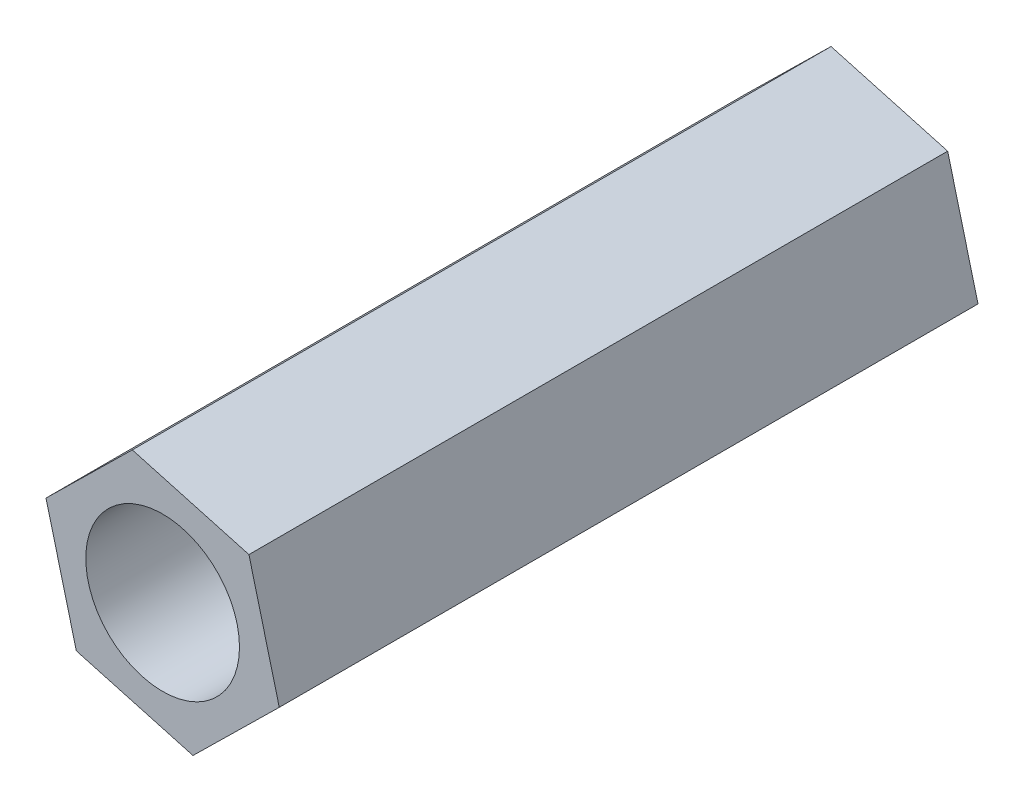
ISO-10303-21;
HEADER;
FILE_DESCRIPTION(('STEP AP214'),'2;1');
FILE_NAME('part.step','',(''),(''),'','','');
FILE_SCHEMA(('AUTOMOTIVE_DESIGN { 1 0 10303 214 1 1 1 1 }'));
ENDSEC;
DATA;
#1=APPLICATION_CONTEXT('core data for automotive mechanical design processes');
#2=APPLICATION_PROTOCOL_DEFINITION('international standard','automotive_design',2000,#1);
#3=PRODUCT_CONTEXT('',#1,'mechanical');
#4=PRODUCT('Part','Part','',(#3));
#5=PRODUCT_RELATED_PRODUCT_CATEGORY('part','',(#4));
#6=PRODUCT_DEFINITION_FORMATION('','',#4);
#7=PRODUCT_DEFINITION_CONTEXT('part definition',#1,'design');
#8=PRODUCT_DEFINITION('design','',#6,#7);
#9=PRODUCT_DEFINITION_SHAPE('','',#8);
#10=(LENGTH_UNIT() NAMED_UNIT(*) SI_UNIT(.MILLI.,.METRE.));
#11=(NAMED_UNIT(*) PLANE_ANGLE_UNIT() SI_UNIT($,.RADIAN.));
#12=(NAMED_UNIT(*) SI_UNIT($,.STERADIAN.) SOLID_ANGLE_UNIT());
#13=UNCERTAINTY_MEASURE_WITH_UNIT(LENGTH_MEASURE(1.E-05),#10,'distance_accuracy_value','');
#14=(GEOMETRIC_REPRESENTATION_CONTEXT(3) GLOBAL_UNCERTAINTY_ASSIGNED_CONTEXT((#13)) GLOBAL_UNIT_ASSIGNED_CONTEXT((#10,
#11,#12)) REPRESENTATION_CONTEXT('',''));
#15=CARTESIAN_POINT('',(0.,0.,0.));
#16=DIRECTION('',(0.,0.,1.));
#17=DIRECTION('',(1.,0.,0.));
#18=AXIS2_PLACEMENT_3D('',#15,#16,#17);
#19=CARTESIAN_POINT('',(0.,0.,15.));
#20=DIRECTION('',(0.,0.,1.));
#21=DIRECTION('',(1.,0.,0.));
#22=AXIS2_PLACEMENT_3D('',#19,#20,#21);
#23=PLANE('',#22);
#24=DIRECTION('',(-0.250589324723524,0.968093482229174,0.));
#25=VECTOR('',#24,1.);
#26=CARTESIAN_POINT('',(2.50373541670728,-0.693764342644977,15.));
#27=LINE('',#26,#25);
#28=CARTESIAN_POINT('',(2.50373541670728,-0.693764342644977,15.));
#29=VERTEX_POINT('',#28);
#30=CARTESIAN_POINT('',(1.852685253324,1.82141630390083,15.));
#31=VERTEX_POINT('',#30);
#32=EDGE_CURVE('E131',#29,#31,#27,.T.);
#33=ORIENTED_EDGE('',*,*,#32,.T.);
#34=DIRECTION('',(-0.963688211210366,0.267030019986828,0.));
#35=VECTOR('',#34,1.);
#36=CARTESIAN_POINT('',(1.852685253324,1.82141630390083,15.));
#37=LINE('',#36,#35);
#38=CARTESIAN_POINT('',(-0.651050163383279,2.51518064654581,15.));
#39=VERTEX_POINT('',#38);
#40=EDGE_CURVE('E89',#31,#39,#37,.T.);
#41=ORIENTED_EDGE('',*,*,#40,.T.);
#42=DIRECTION('',(-0.713098886486842,-0.701063462242347,0.));
#43=VECTOR('',#42,1.);
#44=CARTESIAN_POINT('',(-0.651050163383279,2.51518064654581,15.));
#45=LINE('',#44,#43);
#46=CARTESIAN_POINT('',(-2.50373541670728,0.693764342644976,15.));
#47=VERTEX_POINT('',#46);
#48=EDGE_CURVE('E102',#39,#47,#45,.T.);
#49=ORIENTED_EDGE('',*,*,#48,.T.);
#50=DIRECTION('',(0.250589324723524,-0.968093482229174,0.));
#51=VECTOR('',#50,1.);
#52=CARTESIAN_POINT('',(-2.50373541670728,0.693764342644976,15.));
#53=LINE('',#52,#51);
#54=CARTESIAN_POINT('',(-1.852685253324,-1.82141630390084,15.));
#55=VERTEX_POINT('',#54);
#56=EDGE_CURVE('E96',#47,#55,#53,.T.);
#57=ORIENTED_EDGE('',*,*,#56,.T.);
#58=DIRECTION('',(0.963688211210366,-0.267030019986827,0.));
#59=VECTOR('',#58,1.);
#60=CARTESIAN_POINT('',(-1.852685253324,-1.82141630390084,15.));
#61=LINE('',#60,#59);
#62=CARTESIAN_POINT('',(0.651050163383279,-2.51518064654581,15.));
#63=VERTEX_POINT('',#62);
#64=EDGE_CURVE('E100',#55,#63,#61,.T.);
#65=ORIENTED_EDGE('',*,*,#64,.T.);
#66=DIRECTION('',(0.713098886486842,0.701063462242347,0.));
#67=VECTOR('',#66,1.);
#68=CARTESIAN_POINT('',(0.651050163383279,-2.51518064654581,15.));
#69=LINE('',#68,#67);
#70=EDGE_CURVE('E52',#63,#29,#69,.T.);
#71=ORIENTED_EDGE('',*,*,#70,.T.);
#72=EDGE_LOOP('',(#33,#41,#49,#57,#65,#71));
#73=FACE_BOUND('',#72,.T.);
#74=CARTESIAN_POINT('',(0.,0.,15.));
#75=DIRECTION('',(0.,0.,1.));
#76=DIRECTION('',(1.,0.,0.));
#77=AXIS2_PLACEMENT_3D('',#74,#75,#76);
#78=CIRCLE('',#77,1.65);
#79=CARTESIAN_POINT('',(1.65,0.,15.));
#80=VERTEX_POINT('',#79);
#81=EDGE_CURVE('E124',#80,#80,#78,.T.);
#82=ORIENTED_EDGE('',*,*,#81,.F.);
#83=EDGE_LOOP('',(#82));
#84=FACE_BOUND('',#83,.T.);
#85=ADVANCED_FACE('F35',(#73,#84),#23,.T.);
#86=CARTESIAN_POINT('',(0.,0.,0.));
#87=DIRECTION('',(0.,0.,1.));
#88=DIRECTION('',(1.,0.,0.));
#89=AXIS2_PLACEMENT_3D('',#86,#87,#88);
#90=PLANE('',#89);
#91=DIRECTION('',(-0.250589324723524,0.968093482229174,0.));
#92=VECTOR('',#91,1.);
#93=CARTESIAN_POINT('',(2.50373541670728,-0.693764342644977,0.));
#94=LINE('',#93,#92);
#95=CARTESIAN_POINT('',(2.50373541670728,-0.693764342644977,0.));
#96=VERTEX_POINT('',#95);
#97=CARTESIAN_POINT('',(1.852685253324,1.82141630390083,0.));
#98=VERTEX_POINT('',#97);
#99=EDGE_CURVE('E120',#96,#98,#94,.T.);
#100=ORIENTED_EDGE('',*,*,#99,.F.);
#101=DIRECTION('',(0.713098886486842,0.701063462242347,0.));
#102=VECTOR('',#101,1.);
#103=CARTESIAN_POINT('',(0.651050163383279,-2.51518064654581,0.));
#104=LINE('',#103,#102);
#105=CARTESIAN_POINT('',(0.651050163383279,-2.51518064654581,0.));
#106=VERTEX_POINT('',#105);
#107=EDGE_CURVE('E81',#106,#96,#104,.T.);
#108=ORIENTED_EDGE('',*,*,#107,.F.);
#109=DIRECTION('',(0.963688211210366,-0.267030019986827,0.));
#110=VECTOR('',#109,1.);
#111=CARTESIAN_POINT('',(-1.852685253324,-1.82141630390084,0.));
#112=LINE('',#111,#110);
#113=CARTESIAN_POINT('',(-1.852685253324,-1.82141630390084,0.));
#114=VERTEX_POINT('',#113);
#115=EDGE_CURVE('E75',#114,#106,#112,.T.);
#116=ORIENTED_EDGE('',*,*,#115,.F.);
#117=DIRECTION('',(0.250589324723524,-0.968093482229174,0.));
#118=VECTOR('',#117,1.);
#119=CARTESIAN_POINT('',(-2.50373541670728,0.693764342644976,0.));
#120=LINE('',#119,#118);
#121=CARTESIAN_POINT('',(-2.50373541670728,0.693764342644976,0.));
#122=VERTEX_POINT('',#121);
#123=EDGE_CURVE('E110',#122,#114,#120,.T.);
#124=ORIENTED_EDGE('',*,*,#123,.F.);
#125=DIRECTION('',(-0.713098886486842,-0.701063462242347,0.));
#126=VECTOR('',#125,1.);
#127=CARTESIAN_POINT('',(-0.651050163383279,2.51518064654581,0.));
#128=LINE('',#127,#126);
#129=CARTESIAN_POINT('',(-0.651050163383279,2.51518064654581,0.));
#130=VERTEX_POINT('',#129);
#131=EDGE_CURVE('E126',#130,#122,#128,.T.);
#132=ORIENTED_EDGE('',*,*,#131,.F.);
#133=DIRECTION('',(-0.963688211210366,0.267030019986828,0.));
#134=VECTOR('',#133,1.);
#135=CARTESIAN_POINT('',(1.852685253324,1.82141630390083,0.));
#136=LINE('',#135,#134);
#137=EDGE_CURVE('E123',#98,#130,#136,.T.);
#138=ORIENTED_EDGE('',*,*,#137,.F.);
#139=EDGE_LOOP('',(#100,#108,#116,#124,#132,#138));
#140=FACE_BOUND('',#139,.T.);
#141=CARTESIAN_POINT('',(0.,0.,0.));
#142=DIRECTION('',(0.,0.,1.));
#143=DIRECTION('',(1.,0.,0.));
#144=AXIS2_PLACEMENT_3D('',#141,#142,#143);
#145=CIRCLE('',#144,1.65);
#146=CARTESIAN_POINT('',(1.65,0.,0.));
#147=VERTEX_POINT('',#146);
#148=EDGE_CURVE('E224',#147,#147,#145,.T.);
#149=ORIENTED_EDGE('',*,*,#148,.T.);
#150=EDGE_LOOP('',(#149));
#151=FACE_BOUND('',#150,.T.);
#152=ADVANCED_FACE('F140',(#140,#151),#90,.F.);
#153=CARTESIAN_POINT('',(2.50373541670728,-0.693764342644977,15.));
#154=DIRECTION('',(-0.968093482229174,-0.250589324723524,0.));
#155=DIRECTION('',(0.250589324723524,-0.968093482229174,0.));
#156=AXIS2_PLACEMENT_3D('',#153,#154,#155);
#157=PLANE('',#156);
#158=ORIENTED_EDGE('',*,*,#99,.T.);
#159=DIRECTION('',(0.,0.,-1.));
#160=VECTOR('',#159,1.);
#161=CARTESIAN_POINT('',(1.852685253324,1.82141630390083,15.));
#162=LINE('',#161,#160);
#163=EDGE_CURVE('E11',#31,#98,#162,.T.);
#164=ORIENTED_EDGE('',*,*,#163,.F.);
#165=ORIENTED_EDGE('',*,*,#32,.F.);
#166=DIRECTION('',(0.,0.,-1.));
#167=VECTOR('',#166,1.);
#168=CARTESIAN_POINT('',(2.50373541670728,-0.693764342644977,15.));
#169=LINE('',#168,#167);
#170=EDGE_CURVE('E116',#29,#96,#169,.T.);
#171=ORIENTED_EDGE('',*,*,#170,.T.);
#172=EDGE_LOOP('',(#158,#164,#165,#171));
#173=FACE_BOUND('',#172,.T.);
#174=ADVANCED_FACE('F37',(#173),#157,.F.);
#175=CARTESIAN_POINT('',(1.852685253324,1.82141630390083,15.));
#176=DIRECTION('',(-0.267030019986828,-0.963688211210366,0.));
#177=DIRECTION('',(0.963688211210366,-0.267030019986828,0.));
#178=AXIS2_PLACEMENT_3D('',#175,#176,#177);
#179=PLANE('',#178);
#180=ORIENTED_EDGE('',*,*,#137,.T.);
#181=DIRECTION('',(0.,0.,-1.));
#182=VECTOR('',#181,1.);
#183=CARTESIAN_POINT('',(-0.651050163383279,2.51518064654581,15.));
#184=LINE('',#183,#182);
#185=EDGE_CURVE('E44',#39,#130,#184,.T.);
#186=ORIENTED_EDGE('',*,*,#185,.F.);
#187=ORIENTED_EDGE('',*,*,#40,.F.);
#188=ORIENTED_EDGE('',*,*,#163,.T.);
#189=EDGE_LOOP('',(#180,#186,#187,#188));
#190=FACE_BOUND('',#189,.T.);
#191=ADVANCED_FACE('F165',(#190),#179,.F.);
#192=CARTESIAN_POINT('',(-0.651050163383279,2.51518064654581,15.));
#193=DIRECTION('',(0.701063462242347,-0.713098886486842,0.));
#194=DIRECTION('',(0.713098886486842,0.701063462242347,0.));
#195=AXIS2_PLACEMENT_3D('',#192,#193,#194);
#196=PLANE('',#195);
#197=ORIENTED_EDGE('',*,*,#131,.T.);
#198=DIRECTION('',(0.,0.,-1.));
#199=VECTOR('',#198,1.);
#200=CARTESIAN_POINT('',(-2.50373541670728,0.693764342644976,15.));
#201=LINE('',#200,#199);
#202=EDGE_CURVE('E111',#47,#122,#201,.T.);
#203=ORIENTED_EDGE('',*,*,#202,.F.);
#204=ORIENTED_EDGE('',*,*,#48,.F.);
#205=ORIENTED_EDGE('',*,*,#185,.T.);
#206=EDGE_LOOP('',(#197,#203,#204,#205));
#207=FACE_BOUND('',#206,.T.);
#208=ADVANCED_FACE('F137',(#207),#196,.F.);
#209=CARTESIAN_POINT('',(-2.50373541670728,0.693764342644976,15.));
#210=DIRECTION('',(0.968093482229174,0.250589324723524,0.));
#211=DIRECTION('',(-0.250589324723524,0.968093482229174,0.));
#212=AXIS2_PLACEMENT_3D('',#209,#210,#211);
#213=PLANE('',#212);
#214=ORIENTED_EDGE('',*,*,#123,.T.);
#215=DIRECTION('',(0.,0.,-1.));
#216=VECTOR('',#215,1.);
#217=CARTESIAN_POINT('',(-1.852685253324,-1.82141630390084,15.));
#218=LINE('',#217,#216);
#219=EDGE_CURVE('E107',#55,#114,#218,.T.);
#220=ORIENTED_EDGE('',*,*,#219,.F.);
#221=ORIENTED_EDGE('',*,*,#56,.F.);
#222=ORIENTED_EDGE('',*,*,#202,.T.);
#223=EDGE_LOOP('',(#214,#220,#221,#222));
#224=FACE_BOUND('',#223,.T.);
#225=ADVANCED_FACE('F108',(#224),#213,.F.);
#226=CARTESIAN_POINT('',(-1.852685253324,-1.82141630390084,15.));
#227=DIRECTION('',(0.267030019986827,0.963688211210366,0.));
#228=DIRECTION('',(-0.963688211210366,0.267030019986827,0.));
#229=AXIS2_PLACEMENT_3D('',#226,#227,#228);
#230=PLANE('',#229);
#231=ORIENTED_EDGE('',*,*,#115,.T.);
#232=DIRECTION('',(0.,0.,-1.));
#233=VECTOR('',#232,1.);
#234=CARTESIAN_POINT('',(0.651050163383279,-2.51518064654581,15.));
#235=LINE('',#234,#233);
#236=EDGE_CURVE('E112',#63,#106,#235,.T.);
#237=ORIENTED_EDGE('',*,*,#236,.F.);
#238=ORIENTED_EDGE('',*,*,#64,.F.);
#239=ORIENTED_EDGE('',*,*,#219,.T.);
#240=EDGE_LOOP('',(#231,#237,#238,#239));
#241=FACE_BOUND('',#240,.T.);
#242=ADVANCED_FACE('F114',(#241),#230,.F.);
#243=CARTESIAN_POINT('',(0.651050163383279,-2.51518064654581,15.));
#244=DIRECTION('',(-0.701063462242347,0.713098886486842,0.));
#245=DIRECTION('',(-0.713098886486842,-0.701063462242347,0.));
#246=AXIS2_PLACEMENT_3D('',#243,#244,#245);
#247=PLANE('',#246);
#248=ORIENTED_EDGE('',*,*,#107,.T.);
#249=ORIENTED_EDGE('',*,*,#170,.F.);
#250=ORIENTED_EDGE('',*,*,#70,.F.);
#251=ORIENTED_EDGE('',*,*,#236,.T.);
#252=EDGE_LOOP('',(#248,#249,#250,#251));
#253=FACE_BOUND('',#252,.T.);
#254=ADVANCED_FACE('F145',(#253),#247,.F.);
#255=CARTESIAN_POINT('',(0.,0.,15.));
#256=DIRECTION('',(0.,0.,-1.));
#257=DIRECTION('',(-1.,0.,0.));
#258=AXIS2_PLACEMENT_3D('',#255,#256,#257);
#259=CYLINDRICAL_SURFACE('',#258,1.65);
#260=ORIENTED_EDGE('',*,*,#81,.T.);
#261=EDGE_LOOP('',(#260));
#262=FACE_BOUND('',#261,.T.);
#263=ORIENTED_EDGE('',*,*,#148,.F.);
#264=EDGE_LOOP('',(#263));
#265=FACE_BOUND('',#264,.T.);
#266=ADVANCED_FACE('F147',(#262,#265),#259,.F.);
#267=CLOSED_SHELL('',(#85,#152,#174,#191,#208,#225,#242,#254,#266));
#268=MANIFOLD_SOLID_BREP('B2',#267);
#269=ADVANCED_BREP_SHAPE_REPRESENTATION('',(#18,#268),#14);
#270=SHAPE_DEFINITION_REPRESENTATION(#9,#269);
ENDSEC;
END-ISO-10303-21;
